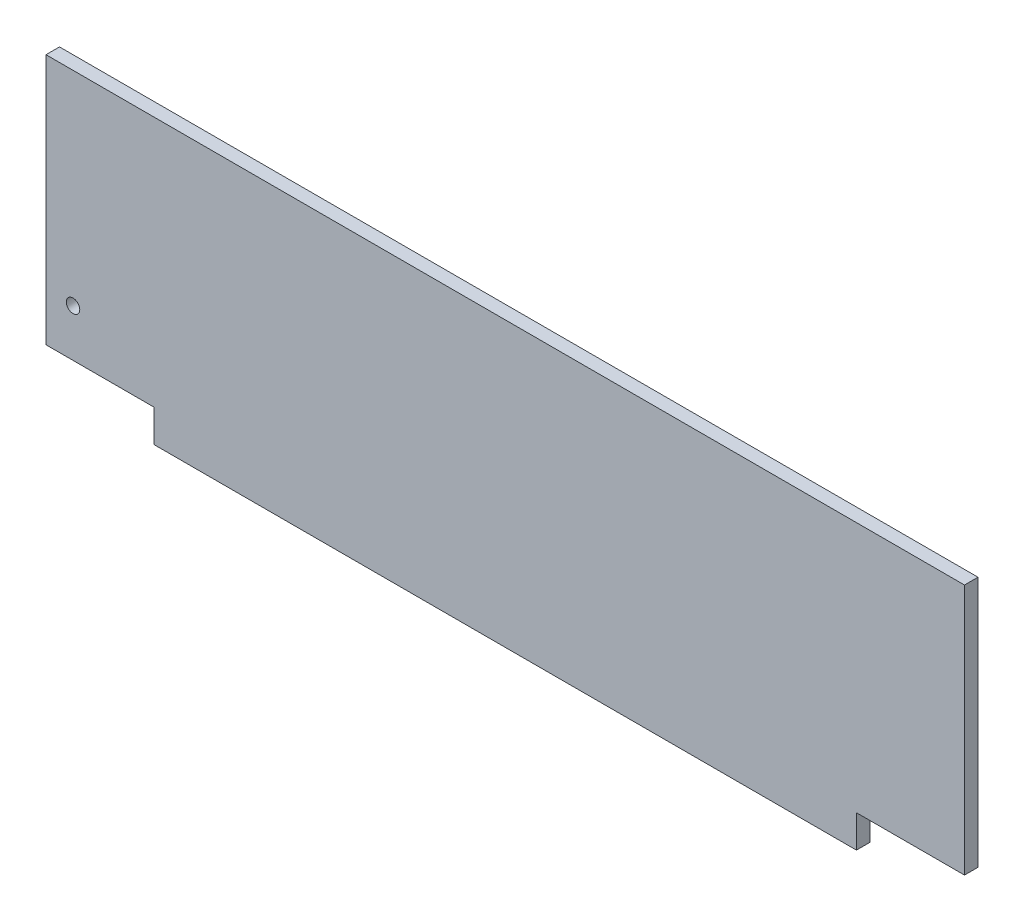
ISO-10303-21;
HEADER;
FILE_DESCRIPTION(('STEP AP214'),'2;1');
FILE_NAME('part.step','',(''),(''),'','','');
FILE_SCHEMA(('AUTOMOTIVE_DESIGN { 1 0 10303 214 1 1 1 1 }'));
ENDSEC;
DATA;
#1=APPLICATION_CONTEXT('core data for automotive mechanical design processes');
#2=APPLICATION_PROTOCOL_DEFINITION('international standard','automotive_design',2000,#1);
#3=PRODUCT_CONTEXT('',#1,'mechanical');
#4=PRODUCT('Part','Part','',(#3));
#5=PRODUCT_RELATED_PRODUCT_CATEGORY('part','',(#4));
#6=PRODUCT_DEFINITION_FORMATION('','',#4);
#7=PRODUCT_DEFINITION_CONTEXT('part definition',#1,'design');
#8=PRODUCT_DEFINITION('design','',#6,#7);
#9=PRODUCT_DEFINITION_SHAPE('','',#8);
#10=(LENGTH_UNIT() NAMED_UNIT(*) SI_UNIT(.MILLI.,.METRE.));
#11=(NAMED_UNIT(*) PLANE_ANGLE_UNIT() SI_UNIT($,.RADIAN.));
#12=(NAMED_UNIT(*) SI_UNIT($,.STERADIAN.) SOLID_ANGLE_UNIT());
#13=UNCERTAINTY_MEASURE_WITH_UNIT(LENGTH_MEASURE(1.E-05),#10,'distance_accuracy_value','');
#14=(GEOMETRIC_REPRESENTATION_CONTEXT(3) GLOBAL_UNCERTAINTY_ASSIGNED_CONTEXT((#13)) GLOBAL_UNIT_ASSIGNED_CONTEXT((#10,
#11,#12)) REPRESENTATION_CONTEXT('',''));
#15=CARTESIAN_POINT('',(0.,0.,0.));
#16=DIRECTION('',(0.,0.,1.));
#17=DIRECTION('',(1.,0.,0.));
#18=AXIS2_PLACEMENT_3D('',#15,#16,#17);
#19=CARTESIAN_POINT('',(-340.,105.,10.));
#20=DIRECTION('',(1.,0.,0.));
#21=DIRECTION('',(0.,0.,-1.));
#22=AXIS2_PLACEMENT_3D('',#19,#20,#21);
#23=PLANE('',#22);
#24=DIRECTION('',(0.,-1.,0.));
#25=VECTOR('',#24,1.);
#26=CARTESIAN_POINT('',(-340.,105.,0.));
#27=LINE('',#26,#25);
#28=CARTESIAN_POINT('',(-340.,105.,0.));
#29=VERTEX_POINT('',#28);
#30=CARTESIAN_POINT('',(-340.,-81.,0.));
#31=VERTEX_POINT('',#30);
#32=EDGE_CURVE('E123',#29,#31,#27,.T.);
#33=ORIENTED_EDGE('',*,*,#32,.T.);
#34=DIRECTION('',(0.,0.,1.));
#35=VECTOR('',#34,1.);
#36=CARTESIAN_POINT('',(-340.,-81.,0.));
#37=LINE('',#36,#35);
#38=CARTESIAN_POINT('',(-340.,-81.,10.));
#39=VERTEX_POINT('',#38);
#40=EDGE_CURVE('E139',#31,#39,#37,.T.);
#41=ORIENTED_EDGE('',*,*,#40,.T.);
#42=DIRECTION('',(0.,-1.,0.));
#43=VECTOR('',#42,1.);
#44=CARTESIAN_POINT('',(-340.,105.,10.));
#45=LINE('',#44,#43);
#46=CARTESIAN_POINT('',(-340.,105.,10.));
#47=VERTEX_POINT('',#46);
#48=EDGE_CURVE('E120',#47,#39,#45,.T.);
#49=ORIENTED_EDGE('',*,*,#48,.F.);
#50=DIRECTION('',(0.,0.,-1.));
#51=VECTOR('',#50,1.);
#52=CARTESIAN_POINT('',(-340.,105.,10.));
#53=LINE('',#52,#51);
#54=EDGE_CURVE('E40',#47,#29,#53,.T.);
#55=ORIENTED_EDGE('',*,*,#54,.T.);
#56=EDGE_LOOP('',(#33,#41,#49,#55));
#57=FACE_BOUND('',#56,.T.);
#58=ADVANCED_FACE('F33',(#57),#23,.F.);
#59=CARTESIAN_POINT('',(-340.,-105.,10.));
#60=DIRECTION('',(0.,1.,0.));
#61=DIRECTION('',(0.,0.,1.));
#62=AXIS2_PLACEMENT_3D('',#59,#60,#61);
#63=PLANE('',#62);
#64=DIRECTION('',(1.,0.,0.));
#65=VECTOR('',#64,1.);
#66=CARTESIAN_POINT('',(-340.,-105.,0.));
#67=LINE('',#66,#65);
#68=CARTESIAN_POINT('',(-260.,-105.,0.));
#69=VERTEX_POINT('',#68);
#70=CARTESIAN_POINT('',(260.,-105.,0.));
#71=VERTEX_POINT('',#70);
#72=EDGE_CURVE('E118',#69,#71,#67,.T.);
#73=ORIENTED_EDGE('',*,*,#72,.T.);
#74=DIRECTION('',(0.,0.,1.));
#75=VECTOR('',#74,1.);
#76=CARTESIAN_POINT('',(260.,-105.,0.));
#77=LINE('',#76,#75);
#78=CARTESIAN_POINT('',(260.,-105.,10.));
#79=VERTEX_POINT('',#78);
#80=EDGE_CURVE('E163',#71,#79,#77,.T.);
#81=ORIENTED_EDGE('',*,*,#80,.T.);
#82=DIRECTION('',(1.,0.,0.));
#83=VECTOR('',#82,1.);
#84=CARTESIAN_POINT('',(-340.,-105.,10.));
#85=LINE('',#84,#83);
#86=CARTESIAN_POINT('',(-260.,-105.,10.));
#87=VERTEX_POINT('',#86);
#88=EDGE_CURVE('E136',#87,#79,#85,.T.);
#89=ORIENTED_EDGE('',*,*,#88,.F.);
#90=DIRECTION('',(0.,0.,1.));
#91=VECTOR('',#90,1.);
#92=CARTESIAN_POINT('',(-260.,-105.,0.));
#93=LINE('',#92,#91);
#94=EDGE_CURVE('E143',#69,#87,#93,.T.);
#95=ORIENTED_EDGE('',*,*,#94,.F.);
#96=EDGE_LOOP('',(#73,#81,#89,#95));
#97=FACE_BOUND('',#96,.T.);
#98=ADVANCED_FACE('F161',(#97),#63,.F.);
#99=CARTESIAN_POINT('',(340.,105.,10.));
#100=DIRECTION('',(-1.,0.,0.));
#101=DIRECTION('',(0.,0.,1.));
#102=AXIS2_PLACEMENT_3D('',#99,#100,#101);
#103=PLANE('',#102);
#104=DIRECTION('',(0.,1.,0.));
#105=VECTOR('',#104,1.);
#106=CARTESIAN_POINT('',(340.,105.,10.));
#107=LINE('',#106,#105);
#108=CARTESIAN_POINT('',(340.,-81.,10.));
#109=VERTEX_POINT('',#108);
#110=CARTESIAN_POINT('',(340.,105.,10.));
#111=VERTEX_POINT('',#110);
#112=EDGE_CURVE('E112',#109,#111,#107,.T.);
#113=ORIENTED_EDGE('',*,*,#112,.F.);
#114=DIRECTION('',(0.,0.,1.));
#115=VECTOR('',#114,1.);
#116=CARTESIAN_POINT('',(340.,-81.,0.));
#117=LINE('',#116,#115);
#118=CARTESIAN_POINT('',(340.,-81.,0.));
#119=VERTEX_POINT('',#118);
#120=EDGE_CURVE('E100',#119,#109,#117,.T.);
#121=ORIENTED_EDGE('',*,*,#120,.F.);
#122=DIRECTION('',(0.,1.,0.));
#123=VECTOR('',#122,1.);
#124=CARTESIAN_POINT('',(340.,105.,0.));
#125=LINE('',#124,#123);
#126=CARTESIAN_POINT('',(340.,105.,0.));
#127=VERTEX_POINT('',#126);
#128=EDGE_CURVE('E111',#119,#127,#125,.T.);
#129=ORIENTED_EDGE('',*,*,#128,.T.);
#130=DIRECTION('',(0.,0.,-1.));
#131=VECTOR('',#130,1.);
#132=CARTESIAN_POINT('',(340.,105.,10.));
#133=LINE('',#132,#131);
#134=EDGE_CURVE('E11',#111,#127,#133,.T.);
#135=ORIENTED_EDGE('',*,*,#134,.F.);
#136=EDGE_LOOP('',(#113,#121,#129,#135));
#137=FACE_BOUND('',#136,.T.);
#138=ADVANCED_FACE('F109',(#137),#103,.F.);
#139=CARTESIAN_POINT('',(-340.,105.,10.));
#140=DIRECTION('',(0.,-1.,0.));
#141=DIRECTION('',(0.,0.,-1.));
#142=AXIS2_PLACEMENT_3D('',#139,#140,#141);
#143=PLANE('',#142);
#144=DIRECTION('',(-1.,0.,0.));
#145=VECTOR('',#144,1.);
#146=CARTESIAN_POINT('',(-340.,105.,0.));
#147=LINE('',#146,#145);
#148=EDGE_CURVE('E117',#127,#29,#147,.T.);
#149=ORIENTED_EDGE('',*,*,#148,.T.);
#150=ORIENTED_EDGE('',*,*,#54,.F.);
#151=DIRECTION('',(-1.,0.,0.));
#152=VECTOR('',#151,1.);
#153=CARTESIAN_POINT('',(-340.,105.,10.));
#154=LINE('',#153,#152);
#155=EDGE_CURVE('E127',#111,#47,#154,.T.);
#156=ORIENTED_EDGE('',*,*,#155,.F.);
#157=ORIENTED_EDGE('',*,*,#134,.T.);
#158=EDGE_LOOP('',(#149,#150,#156,#157));
#159=FACE_BOUND('',#158,.T.);
#160=ADVANCED_FACE('F183',(#159),#143,.F.);
#161=CARTESIAN_POINT('',(0.,0.,10.));
#162=DIRECTION('',(0.,0.,1.));
#163=DIRECTION('',(1.,0.,0.));
#164=AXIS2_PLACEMENT_3D('',#161,#162,#163);
#165=PLANE('',#164);
#166=CARTESIAN_POINT('',(-320.,-46.,10.));
#167=DIRECTION('',(0.,0.,1.));
#168=DIRECTION('',(1.,0.,0.));
#169=AXIS2_PLACEMENT_3D('',#166,#167,#168);
#170=CIRCLE('',#169,4.99999999999999);
#171=CARTESIAN_POINT('',(-315.,-46.,10.));
#172=VERTEX_POINT('',#171);
#173=EDGE_CURVE('E215',#172,#172,#170,.T.);
#174=ORIENTED_EDGE('',*,*,#173,.F.);
#175=EDGE_LOOP('',(#174));
#176=FACE_BOUND('',#175,.T.);
#177=DIRECTION('',(0.,-1.,0.));
#178=VECTOR('',#177,1.);
#179=CARTESIAN_POINT('',(260.,-105.,10.));
#180=LINE('',#179,#178);
#181=CARTESIAN_POINT('',(260.,-81.,10.));
#182=VERTEX_POINT('',#181);
#183=EDGE_CURVE('E105',#182,#79,#180,.T.);
#184=ORIENTED_EDGE('',*,*,#183,.F.);
#185=DIRECTION('',(-1.,0.,0.));
#186=VECTOR('',#185,1.);
#187=CARTESIAN_POINT('',(340.,-81.,10.));
#188=LINE('',#187,#186);
#189=EDGE_CURVE('E217',#109,#182,#188,.T.);
#190=ORIENTED_EDGE('',*,*,#189,.F.);
#191=ORIENTED_EDGE('',*,*,#112,.T.);
#192=ORIENTED_EDGE('',*,*,#155,.T.);
#193=ORIENTED_EDGE('',*,*,#48,.T.);
#194=DIRECTION('',(-1.,0.,0.));
#195=VECTOR('',#194,1.);
#196=CARTESIAN_POINT('',(-340.,-81.,10.));
#197=LINE('',#196,#195);
#198=CARTESIAN_POINT('',(-260.,-81.,10.));
#199=VERTEX_POINT('',#198);
#200=EDGE_CURVE('E146',#199,#39,#197,.T.);
#201=ORIENTED_EDGE('',*,*,#200,.F.);
#202=DIRECTION('',(0.,1.,0.));
#203=VECTOR('',#202,1.);
#204=CARTESIAN_POINT('',(-260.,-105.,10.));
#205=LINE('',#204,#203);
#206=EDGE_CURVE('E157',#87,#199,#205,.T.);
#207=ORIENTED_EDGE('',*,*,#206,.F.);
#208=ORIENTED_EDGE('',*,*,#88,.T.);
#209=EDGE_LOOP('',(#184,#190,#191,#192,#193,#201,#207,#208));
#210=FACE_BOUND('',#209,.T.);
#211=ADVANCED_FACE('F154',(#176,#210),#165,.T.);
#212=CARTESIAN_POINT('',(0.,0.,0.));
#213=DIRECTION('',(0.,0.,1.));
#214=DIRECTION('',(1.,0.,0.));
#215=AXIS2_PLACEMENT_3D('',#212,#213,#214);
#216=PLANE('',#215);
#217=CARTESIAN_POINT('',(-320.,-46.,0.));
#218=DIRECTION('',(0.,0.,1.));
#219=DIRECTION('',(1.,0.,0.));
#220=AXIS2_PLACEMENT_3D('',#217,#218,#219);
#221=CIRCLE('',#220,4.99999999999999);
#222=CARTESIAN_POINT('',(-315.,-46.,0.));
#223=VERTEX_POINT('',#222);
#224=EDGE_CURVE('E212',#223,#223,#221,.T.);
#225=ORIENTED_EDGE('',*,*,#224,.T.);
#226=EDGE_LOOP('',(#225));
#227=FACE_BOUND('',#226,.T.);
#228=DIRECTION('',(-1.,0.,0.));
#229=VECTOR('',#228,1.);
#230=CARTESIAN_POINT('',(340.,-81.,0.));
#231=LINE('',#230,#229);
#232=CARTESIAN_POINT('',(260.,-81.,0.));
#233=VERTEX_POINT('',#232);
#234=EDGE_CURVE('E96',#119,#233,#231,.T.);
#235=ORIENTED_EDGE('',*,*,#234,.T.);
#236=DIRECTION('',(0.,-1.,0.));
#237=VECTOR('',#236,1.);
#238=CARTESIAN_POINT('',(260.,-105.,0.));
#239=LINE('',#238,#237);
#240=EDGE_CURVE('E47',#233,#71,#239,.T.);
#241=ORIENTED_EDGE('',*,*,#240,.T.);
#242=ORIENTED_EDGE('',*,*,#72,.F.);
#243=DIRECTION('',(0.,1.,0.));
#244=VECTOR('',#243,1.);
#245=CARTESIAN_POINT('',(-260.,-105.,0.));
#246=LINE('',#245,#244);
#247=CARTESIAN_POINT('',(-260.,-81.,0.));
#248=VERTEX_POINT('',#247);
#249=EDGE_CURVE('E169',#69,#248,#246,.T.);
#250=ORIENTED_EDGE('',*,*,#249,.T.);
#251=DIRECTION('',(-1.,0.,0.));
#252=VECTOR('',#251,1.);
#253=CARTESIAN_POINT('',(-340.,-81.,0.));
#254=LINE('',#253,#252);
#255=EDGE_CURVE('E55',#248,#31,#254,.T.);
#256=ORIENTED_EDGE('',*,*,#255,.T.);
#257=ORIENTED_EDGE('',*,*,#32,.F.);
#258=ORIENTED_EDGE('',*,*,#148,.F.);
#259=ORIENTED_EDGE('',*,*,#128,.F.);
#260=EDGE_LOOP('',(#235,#241,#242,#250,#256,#257,#258,#259));
#261=FACE_BOUND('',#260,.T.);
#262=ADVANCED_FACE('F115',(#227,#261),#216,.F.);
#263=CARTESIAN_POINT('',(-340.,-81.,0.));
#264=DIRECTION('',(0.,1.,0.));
#265=DIRECTION('',(0.,0.,1.));
#266=AXIS2_PLACEMENT_3D('',#263,#264,#265);
#267=PLANE('',#266);
#268=ORIENTED_EDGE('',*,*,#200,.T.);
#269=ORIENTED_EDGE('',*,*,#40,.F.);
#270=ORIENTED_EDGE('',*,*,#255,.F.);
#271=DIRECTION('',(0.,0.,1.));
#272=VECTOR('',#271,1.);
#273=CARTESIAN_POINT('',(-260.,-81.,0.));
#274=LINE('',#273,#272);
#275=EDGE_CURVE('E141',#248,#199,#274,.T.);
#276=ORIENTED_EDGE('',*,*,#275,.T.);
#277=EDGE_LOOP('',(#268,#269,#270,#276));
#278=FACE_BOUND('',#277,.T.);
#279=ADVANCED_FACE('F174',(#278),#267,.F.);
#280=CARTESIAN_POINT('',(-260.,-105.,0.));
#281=DIRECTION('',(1.,0.,0.));
#282=DIRECTION('',(0.,0.,-1.));
#283=AXIS2_PLACEMENT_3D('',#280,#281,#282);
#284=PLANE('',#283);
#285=ORIENTED_EDGE('',*,*,#206,.T.);
#286=ORIENTED_EDGE('',*,*,#275,.F.);
#287=ORIENTED_EDGE('',*,*,#249,.F.);
#288=ORIENTED_EDGE('',*,*,#94,.T.);
#289=EDGE_LOOP('',(#285,#286,#287,#288));
#290=FACE_BOUND('',#289,.T.);
#291=ADVANCED_FACE('F173',(#290),#284,.F.);
#292=CARTESIAN_POINT('',(260.,-105.,0.));
#293=DIRECTION('',(-1.,0.,0.));
#294=DIRECTION('',(0.,0.,1.));
#295=AXIS2_PLACEMENT_3D('',#292,#293,#294);
#296=PLANE('',#295);
#297=ORIENTED_EDGE('',*,*,#183,.T.);
#298=ORIENTED_EDGE('',*,*,#80,.F.);
#299=ORIENTED_EDGE('',*,*,#240,.F.);
#300=DIRECTION('',(0.,0.,1.));
#301=VECTOR('',#300,1.);
#302=CARTESIAN_POINT('',(260.,-81.,0.));
#303=LINE('',#302,#301);
#304=EDGE_CURVE('E102',#233,#182,#303,.T.);
#305=ORIENTED_EDGE('',*,*,#304,.T.);
#306=EDGE_LOOP('',(#297,#298,#299,#305));
#307=FACE_BOUND('',#306,.T.);
#308=ADVANCED_FACE('F197',(#307),#296,.F.);
#309=CARTESIAN_POINT('',(340.,-81.,0.));
#310=DIRECTION('',(0.,1.,0.));
#311=DIRECTION('',(-1.,0.,0.));
#312=AXIS2_PLACEMENT_3D('',#309,#310,#311);
#313=PLANE('',#312);
#314=ORIENTED_EDGE('',*,*,#189,.T.);
#315=ORIENTED_EDGE('',*,*,#304,.F.);
#316=ORIENTED_EDGE('',*,*,#234,.F.);
#317=ORIENTED_EDGE('',*,*,#120,.T.);
#318=EDGE_LOOP('',(#314,#315,#316,#317));
#319=FACE_BOUND('',#318,.T.);
#320=ADVANCED_FACE('F99',(#319),#313,.F.);
#321=CARTESIAN_POINT('',(-320.,-46.,0.));
#322=DIRECTION('',(0.,0.,1.));
#323=DIRECTION('',(1.,0.,0.));
#324=AXIS2_PLACEMENT_3D('',#321,#322,#323);
#325=CYLINDRICAL_SURFACE('',#324,4.99999999999999);
#326=ORIENTED_EDGE('',*,*,#224,.F.);
#327=EDGE_LOOP('',(#326));
#328=FACE_BOUND('',#327,.T.);
#329=ORIENTED_EDGE('',*,*,#173,.T.);
#330=EDGE_LOOP('',(#329));
#331=FACE_BOUND('',#330,.T.);
#332=ADVANCED_FACE('F202',(#328,#331),#325,.F.);
#333=CLOSED_SHELL('',(#58,#98,#138,#160,#211,#262,#279,#291,#308,#320,#332));
#334=MANIFOLD_SOLID_BREP('B2',#333);
#335=ADVANCED_BREP_SHAPE_REPRESENTATION('',(#18,#334),#14);
#336=SHAPE_DEFINITION_REPRESENTATION(#9,#335);
ENDSEC;
END-ISO-10303-21;
